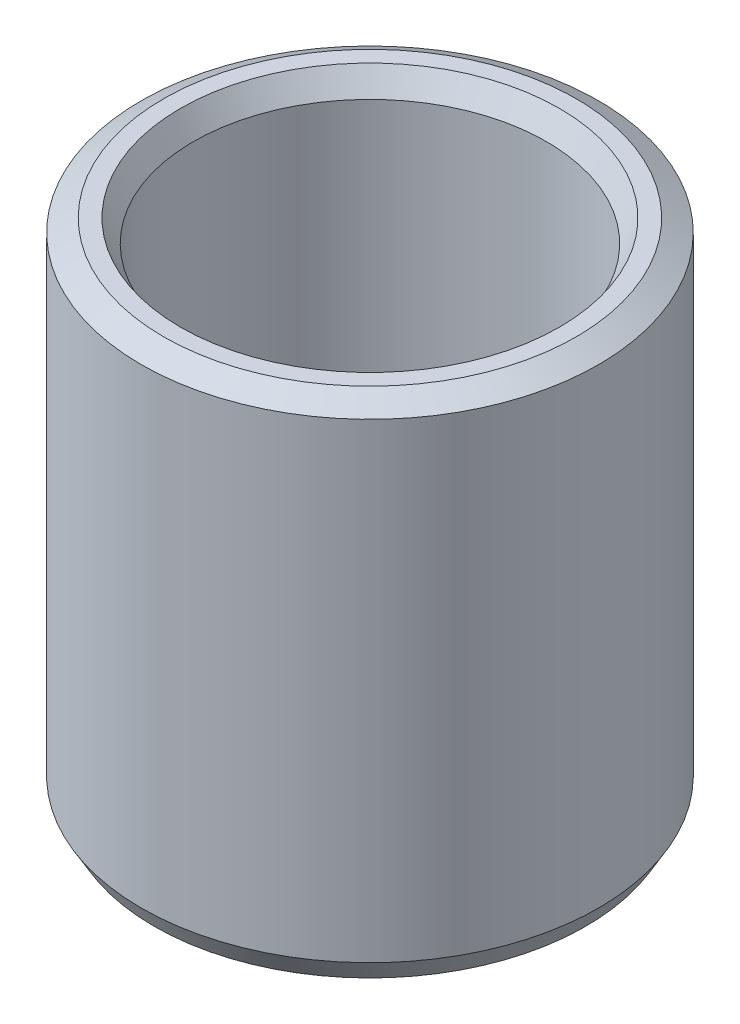
ISO-10303-21;
HEADER;
FILE_DESCRIPTION(('STEP AP214'),'2;1');
FILE_NAME('part.step','',(''),(''),'','','');
FILE_SCHEMA(('AUTOMOTIVE_DESIGN { 1 0 10303 214 1 1 1 1 }'));
ENDSEC;
DATA;
#1=APPLICATION_CONTEXT('core data for automotive mechanical design processes');
#2=APPLICATION_PROTOCOL_DEFINITION('international standard','automotive_design',2000,#1);
#3=PRODUCT_CONTEXT('',#1,'mechanical');
#4=PRODUCT('Part','Part','',(#3));
#5=PRODUCT_RELATED_PRODUCT_CATEGORY('part','',(#4));
#6=PRODUCT_DEFINITION_FORMATION('','',#4);
#7=PRODUCT_DEFINITION_CONTEXT('part definition',#1,'design');
#8=PRODUCT_DEFINITION('design','',#6,#7);
#9=PRODUCT_DEFINITION_SHAPE('','',#8);
#10=(LENGTH_UNIT() NAMED_UNIT(*) SI_UNIT(.MILLI.,.METRE.));
#11=(NAMED_UNIT(*) PLANE_ANGLE_UNIT() SI_UNIT($,.RADIAN.));
#12=(NAMED_UNIT(*) SI_UNIT($,.STERADIAN.) SOLID_ANGLE_UNIT());
#13=UNCERTAINTY_MEASURE_WITH_UNIT(LENGTH_MEASURE(1.E-05),#10,'distance_accuracy_value','');
#14=(GEOMETRIC_REPRESENTATION_CONTEXT(3) GLOBAL_UNCERTAINTY_ASSIGNED_CONTEXT((#13)) GLOBAL_UNIT_ASSIGNED_CONTEXT((#10,
#11,#12)) REPRESENTATION_CONTEXT('',''));
#15=CARTESIAN_POINT('',(0.,0.,0.));
#16=DIRECTION('',(0.,0.,1.));
#17=DIRECTION('',(1.,0.,0.));
#18=AXIS2_PLACEMENT_3D('',#15,#16,#17);
#19=CARTESIAN_POINT('',(0.,110.624641812526,0.));
#20=DIRECTION('',(0.,-1.,0.));
#21=DIRECTION('',(0.,0.,-1.));
#22=AXIS2_PLACEMENT_3D('',#19,#20,#21);
#23=CYLINDRICAL_SURFACE('',#22,50.);
#24=CARTESIAN_POINT('',(0.,4.88620074329169,0.));
#25=DIRECTION('',(0.,1.,0.));
#26=DIRECTION('',(0.,0.,1.));
#27=AXIS2_PLACEMENT_3D('',#24,#25,#26);
#28=CIRCLE('',#27,50.);
#29=CARTESIAN_POINT('',(0.,4.88620074329169,50.));
#30=VERTEX_POINT('',#29);
#31=EDGE_CURVE('E10',#30,#30,#28,.T.);
#32=ORIENTED_EDGE('',*,*,#31,.T.);
#33=EDGE_LOOP('',(#32));
#34=FACE_BOUND('',#33,.T.);
#35=CARTESIAN_POINT('',(0.,107.803592498072,0.));
#36=DIRECTION('',(0.,1.,0.));
#37=DIRECTION('',(0.,0.,1.));
#38=AXIS2_PLACEMENT_3D('',#35,#36,#37);
#39=CIRCLE('',#38,50.);
#40=CARTESIAN_POINT('',(0.,107.803592498072,50.));
#41=VERTEX_POINT('',#40);
#42=EDGE_CURVE('E50',#41,#41,#39,.F.);
#43=ORIENTED_EDGE('',*,*,#42,.T.);
#44=EDGE_LOOP('',(#43));
#45=FACE_BOUND('',#44,.T.);
#46=ADVANCED_FACE('F39',(#34,#45),#23,.T.);
#47=CARTESIAN_POINT('',(0.,110.624641812526,0.));
#48=DIRECTION('',(0.,1.,0.));
#49=DIRECTION('',(0.,0.,1.));
#50=AXIS2_PLACEMENT_3D('',#47,#48,#49);
#51=PLANE('',#50);
#52=CARTESIAN_POINT('',(0.,110.624641812526,0.));
#53=DIRECTION('',(0.,1.,0.));
#54=DIRECTION('',(0.,0.,1.));
#55=AXIS2_PLACEMENT_3D('',#52,#53,#54);
#56=CIRCLE('',#55,41.4435960448533);
#57=CARTESIAN_POINT('',(0.,110.624641812526,41.4435960448533));
#58=VERTEX_POINT('',#57);
#59=EDGE_CURVE('E58',#58,#58,#56,.F.);
#60=ORIENTED_EDGE('',*,*,#59,.T.);
#61=EDGE_LOOP('',(#60));
#62=FACE_BOUND('',#61,.T.);
#63=CARTESIAN_POINT('',(0.,110.624641812526,0.));
#64=DIRECTION('',(0.,1.,0.));
#65=DIRECTION('',(0.,0.,1.));
#66=AXIS2_PLACEMENT_3D('',#63,#64,#65);
#67=CIRCLE('',#66,45.1137992567082);
#68=CARTESIAN_POINT('',(0.,110.624641812526,45.1137992567082));
#69=VERTEX_POINT('',#68);
#70=EDGE_CURVE('E61',#69,#69,#67,.T.);
#71=ORIENTED_EDGE('',*,*,#70,.T.);
#72=EDGE_LOOP('',(#71));
#73=FACE_BOUND('',#72,.T.);
#74=ADVANCED_FACE('F88',(#62,#73),#51,.T.);
#75=CARTESIAN_POINT('',(0.,0.,0.));
#76=DIRECTION('',(0.,1.,0.));
#77=DIRECTION('',(0.,0.,1.));
#78=AXIS2_PLACEMENT_3D('',#75,#76,#77);
#79=PLANE('',#78);
#80=CARTESIAN_POINT('',(0.,0.,0.));
#81=DIRECTION('',(0.,1.,0.));
#82=DIRECTION('',(0.,0.,1.));
#83=AXIS2_PLACEMENT_3D('',#80,#81,#82);
#84=CIRCLE('',#83,43.508747473691);
#85=CARTESIAN_POINT('',(0.,0.,43.508747473691));
#86=VERTEX_POINT('',#85);
#87=EDGE_CURVE('E51',#86,#86,#84,.T.);
#88=ORIENTED_EDGE('',*,*,#87,.T.);
#89=EDGE_LOOP('',(#88));
#90=FACE_BOUND('',#89,.T.);
#91=CARTESIAN_POINT('',(0.,0.,0.));
#92=DIRECTION('',(0.,1.,0.));
#93=DIRECTION('',(0.,0.,1.));
#94=AXIS2_PLACEMENT_3D('',#91,#92,#93);
#95=CIRCLE('',#94,47.178950685546);
#96=CARTESIAN_POINT('',(0.,0.,47.178950685546));
#97=VERTEX_POINT('',#96);
#98=EDGE_CURVE('E54',#97,#97,#95,.F.);
#99=ORIENTED_EDGE('',*,*,#98,.T.);
#100=EDGE_LOOP('',(#99));
#101=FACE_BOUND('',#100,.T.);
#102=ADVANCED_FACE('F83',(#90,#101),#79,.F.);
#103=CARTESIAN_POINT('',(0.,110.624641812526,0.));
#104=DIRECTION('',(0.,-1.,0.));
#105=DIRECTION('',(0.,0.,-1.));
#106=AXIS2_PLACEMENT_3D('',#103,#104,#105);
#107=CYLINDRICAL_SURFACE('',#106,38.6225467303992);
#108=CARTESIAN_POINT('',(0.,105.738441069234,0.));
#109=DIRECTION('',(0.,1.,0.));
#110=DIRECTION('',(0.,0.,1.));
#111=AXIS2_PLACEMENT_3D('',#108,#109,#110);
#112=CIRCLE('',#111,38.6225467303992);
#113=CARTESIAN_POINT('',(0.,105.738441069234,38.6225467303992));
#114=VERTEX_POINT('',#113);
#115=EDGE_CURVE('E67',#114,#114,#112,.T.);
#116=ORIENTED_EDGE('',*,*,#115,.T.);
#117=EDGE_LOOP('',(#116));
#118=FACE_BOUND('',#117,.T.);
#119=CARTESIAN_POINT('',(0.,2.82104931445408,0.));
#120=DIRECTION('',(0.,1.,0.));
#121=DIRECTION('',(0.,0.,1.));
#122=AXIS2_PLACEMENT_3D('',#119,#120,#121);
#123=CIRCLE('',#122,38.6225467303992);
#124=CARTESIAN_POINT('',(0.,2.82104931445408,38.6225467303992));
#125=VERTEX_POINT('',#124);
#126=EDGE_CURVE('E69',#125,#125,#123,.F.);
#127=ORIENTED_EDGE('',*,*,#126,.T.);
#128=EDGE_LOOP('',(#127));
#129=FACE_BOUND('',#128,.T.);
#130=ADVANCED_FACE('F71',(#118,#129),#107,.F.);
#131=CARTESIAN_POINT('',(0.,105.738441069234,0.));
#132=DIRECTION('',(0.,1.,0.));
#133=DIRECTION('',(0.,0.,1.));
#134=AXIS2_PLACEMENT_3D('',#131,#132,#133);
#135=CONICAL_SURFACE('',#134,38.6225467303992,0.523598775598304);
#136=CARTESIAN_POINT('',(0.,110.624641812526,41.4435960448533));
#137=CARTESIAN_POINT('',(0.,110.573743888117,41.4142101144944));
#138=CARTESIAN_POINT('',(0.,110.522845963707,41.3848241841355));
#139=CARTESIAN_POINT('',(0.,110.421050114889,41.3260523234177));
#140=CARTESIAN_POINT('',(0.,110.370152190479,41.2966663930588));
#141=CARTESIAN_POINT('',(0.,110.268356341661,41.237894532341));
#142=CARTESIAN_POINT('',(0.,110.217458417251,41.2085086019821));
#143=CARTESIAN_POINT('',(0.,110.115662568433,41.1497367412643));
#144=CARTESIAN_POINT('',(0.,110.064764644024,41.1203508109054));
#145=CARTESIAN_POINT('',(0.,109.962968795205,41.0615789501876));
#146=CARTESIAN_POINT('',(0.,109.912070870796,41.0321930198287));
#147=CARTESIAN_POINT('',(0.,109.810275021977,40.9734211591109));
#148=CARTESIAN_POINT('',(0.,109.759377097568,40.9440352287521));
#149=CARTESIAN_POINT('',(0.,109.657581248749,40.8852633680343));
#150=CARTESIAN_POINT('',(0.,109.60668332434,40.8558774376754));
#151=CARTESIAN_POINT('',(0.,109.504887475521,40.7971055769576));
#152=CARTESIAN_POINT('',(0.,109.453989551112,40.7677196465987));
#153=CARTESIAN_POINT('',(0.,109.352193702294,40.7089477858809));
#154=CARTESIAN_POINT('',(0.,109.301295777884,40.679561855522));
#155=CARTESIAN_POINT('',(0.,109.199499929066,40.6207899948042));
#156=CARTESIAN_POINT('',(0.,109.148602004656,40.5914040644453));
#157=CARTESIAN_POINT('',(0.,109.046806155838,40.5326322037275));
#158=CARTESIAN_POINT('',(0.,108.995908231429,40.5032462733686));
#159=CARTESIAN_POINT('',(0.,108.89411238261,40.4444744126508));
#160=CARTESIAN_POINT('',(0.,108.843214458201,40.4150884822919));
#161=CARTESIAN_POINT('',(0.,108.741418609382,40.3563166215741));
#162=CARTESIAN_POINT('',(0.,108.690520684973,40.3269306912152));
#163=CARTESIAN_POINT('',(0.,108.588724836154,40.2681588304974));
#164=CARTESIAN_POINT('',(0.,108.537826911745,40.2387729001385));
#165=CARTESIAN_POINT('',(0.,108.436031062926,40.1800010394207));
#166=CARTESIAN_POINT('',(0.,108.385133138517,40.1506151090618));
#167=CARTESIAN_POINT('',(0.,108.283337289698,40.091843248344));
#168=CARTESIAN_POINT('',(0.,108.232439365289,40.0624573179851));
#169=CARTESIAN_POINT('',(0.,108.130643516471,40.0036854572673));
#170=CARTESIAN_POINT('',(0.,108.079745592061,39.9742995269084));
#171=CARTESIAN_POINT('',(0.,107.977949743243,39.9155276661907));
#172=CARTESIAN_POINT('',(0.,107.927051818833,39.8861417358318));
#173=CARTESIAN_POINT('',(0.,107.825255970015,39.827369875114));
#174=CARTESIAN_POINT('',(0.,107.774358045606,39.7979839447551));
#175=CARTESIAN_POINT('',(0.,107.672562196787,39.7392120840373));
#176=CARTESIAN_POINT('',(0.,107.621664272378,39.7098261536784));
#177=CARTESIAN_POINT('',(0.,107.519868423559,39.6510542929606));
#178=CARTESIAN_POINT('',(0.,107.46897049915,39.6216683626017));
#179=CARTESIAN_POINT('',(0.,107.367174650331,39.5628965018839));
#180=CARTESIAN_POINT('',(0.,107.316276725922,39.533510571525));
#181=CARTESIAN_POINT('',(0.,107.214480877103,39.4747387108072));
#182=CARTESIAN_POINT('',(0.,107.163582952694,39.4453527804483));
#183=CARTESIAN_POINT('',(0.,107.061787103876,39.3865809197305));
#184=CARTESIAN_POINT('',(0.,107.010889179466,39.3571949893716));
#185=CARTESIAN_POINT('',(0.,106.909093330648,39.2984231286538));
#186=CARTESIAN_POINT('',(0.,106.858195406238,39.2690371982949));
#187=CARTESIAN_POINT('',(0.,106.75639955742,39.2102653375771));
#188=CARTESIAN_POINT('',(0.,106.70550163301,39.1808794072182));
#189=CARTESIAN_POINT('',(0.,106.603705784192,39.1221075465004));
#190=CARTESIAN_POINT('',(0.,106.552807859783,39.0927216161415));
#191=CARTESIAN_POINT('',(0.,106.451012010964,39.0339497554237));
#192=CARTESIAN_POINT('',(0.,106.400114086555,39.0045638250649));
#193=CARTESIAN_POINT('',(0.,106.298318237736,38.9457919643471));
#194=CARTESIAN_POINT('',(0.,106.247420313327,38.9164060339882));
#195=CARTESIAN_POINT('',(0.,106.145624464508,38.8576341732704));
#196=CARTESIAN_POINT('',(0.,106.094726540099,38.8282482429115));
#197=CARTESIAN_POINT('',(0.,105.99293069128,38.7694763821937));
#198=CARTESIAN_POINT('',(0.,105.942032766871,38.7400904518348));
#199=CARTESIAN_POINT('',(0.,105.840236918053,38.681318591117));
#200=CARTESIAN_POINT('',(0.,105.789338993643,38.6519326607581));
#201=CARTESIAN_POINT('',(0.,105.738441069234,38.6225467303992));
#202=B_SPLINE_CURVE_WITH_KNOTS('',3,(#136,#137,#138,#139,#140,#141,#142,#143,#144,#145,#146,
#147,#148,#149,#150,#151,#152,#153,#154,#155,#156,#157,#158,#159,#160,#161,#162,#163,#164,#165,
#166,#167,#168,#169,#170,#171,#172,#173,#174,#175,#176,#177,#178,#179,#180,#181,#182,#183,#184,
#185,#186,#187,#188,#189,#190,#191,#192,#193,#194,#195,#196,#197,#198,#199,#200,#201),
.UNSPECIFIED.,.F.,.F.,(4,2,2,2,2,2,2,2,2,2,2,2,2,2,2,2,2,2,2,2,2,2,2,2,2,2,2,2,2,2,2,2,4),(0.,
0.176315582153392,0.352631164306769,0.528946746460145,0.705262328613525,0.881577910766914,
1.05789349292029,1.23420907507367,1.41052465722705,1.58684023938042,1.76315582153382,
1.93947140368719,2.11578698584057,2.29210256799395,2.46841815014734,2.64473373230071,
2.82104931445409,2.99736489660747,3.17368047876085,3.34999606091423,3.52631164306761,
3.70262722522099,3.87894280737437,4.05525838952776,4.23157397168114,4.40788955383451,
4.58420513598789,4.76052071814127,4.93683630029466,5.11315188244804,5.28946746460141,
5.46578304675479,5.64209862890817),.UNSPECIFIED.);
#203=EDGE_CURVE('BSEAM77',#58,#114,#202,.T.);
#204=ORIENTED_EDGE('',*,*,#59,.F.);
#205=ORIENTED_EDGE('',*,*,#115,.F.);
#206=ORIENTED_EDGE('',*,*,#203,.T.);
#207=ORIENTED_EDGE('',*,*,#203,.F.);
#208=EDGE_LOOP('',(#204,#206,#205,#207));
#209=FACE_BOUND('',#208,.T.);
#210=ADVANCED_FACE('F77',(#209),#135,.F.);
#211=CARTESIAN_POINT('',(0.,0.,0.));
#212=DIRECTION('',(0.,-1.,0.));
#213=DIRECTION('',(0.,0.,-1.));
#214=AXIS2_PLACEMENT_3D('',#211,#212,#213);
#215=CONICAL_SURFACE('',#214,43.508747473691,1.0471975511966);
#216=ORIENTED_EDGE('',*,*,#126,.F.);
#217=EDGE_LOOP('',(#216));
#218=FACE_BOUND('',#217,.T.);
#219=ORIENTED_EDGE('',*,*,#87,.F.);
#220=EDGE_LOOP('',(#219));
#221=FACE_BOUND('',#220,.T.);
#222=ADVANCED_FACE('F73',(#218,#221),#215,.F.);
#223=CARTESIAN_POINT('',(0.,4.88620074329169,0.));
#224=DIRECTION('',(0.,1.,0.));
#225=DIRECTION('',(0.,0.,1.));
#226=AXIS2_PLACEMENT_3D('',#223,#224,#225);
#227=CONICAL_SURFACE('',#226,50.,0.523598775598304);
#228=CARTESIAN_POINT('',(0.,0.,47.178950685546));
#229=CARTESIAN_POINT('',(0.,0.0508979244092874,47.2083366159049));
#230=CARTESIAN_POINT('',(0.,0.101795848818576,47.2377225462638));
#231=CARTESIAN_POINT('',(0.,0.203591697637153,47.2964944069815));
#232=CARTESIAN_POINT('',(0.,0.254489622046441,47.3258803373405));
#233=CARTESIAN_POINT('',(0.,0.356285470865018,47.3846521980582));
#234=CARTESIAN_POINT('',(0.,0.407183395274306,47.4140381284171));
#235=CARTESIAN_POINT('',(0.,0.508979244092883,47.4728099891349));
#236=CARTESIAN_POINT('',(0.,0.559877168502171,47.5021959194938));
#237=CARTESIAN_POINT('',(0.,0.661673017320748,47.5609677802116));
#238=CARTESIAN_POINT('',(0.,0.712570941730037,47.5903537105705));
#239=CARTESIAN_POINT('',(0.,0.814366790548613,47.6491255712883));
#240=CARTESIAN_POINT('',(0.,0.865264714957902,47.6785115016472));
#241=CARTESIAN_POINT('',(0.,0.967060563776479,47.737283362365));
#242=CARTESIAN_POINT('',(0.,1.01795848818577,47.7666692927239));
#243=CARTESIAN_POINT('',(0.,1.11975433700434,47.8254411534417));
#244=CARTESIAN_POINT('',(0.,1.17065226141363,47.8548270838006));
#245=CARTESIAN_POINT('',(0.,1.27244811023221,47.9135989445184));
#246=CARTESIAN_POINT('',(0.,1.3233460346415,47.9429848748773));
#247=CARTESIAN_POINT('',(0.,1.42514188346007,48.0017567355951));
#248=CARTESIAN_POINT('',(0.,1.47603980786936,48.031142665954));
#249=CARTESIAN_POINT('',(0.,1.57783565668794,48.0899145266717));
#250=CARTESIAN_POINT('',(0.,1.62873358109723,48.1193004570306));
#251=CARTESIAN_POINT('',(0.,1.7305294299158,48.1780723177484));
#252=CARTESIAN_POINT('',(0.,1.78142735432509,48.2074582481073));
#253=CARTESIAN_POINT('',(0.,1.88322320314367,48.2662301088251));
#254=CARTESIAN_POINT('',(0.,1.93412112755296,48.295616039184));
#255=CARTESIAN_POINT('',(0.,2.03591697637154,48.3543878999018));
#256=CARTESIAN_POINT('',(0.,2.08681490078082,48.3837738302607));
#257=CARTESIAN_POINT('',(0.,2.1886107495994,48.4425456909785));
#258=CARTESIAN_POINT('',(0.,2.23950867400869,48.4719316213374));
#259=CARTESIAN_POINT('',(0.,2.34130452282727,48.5307034820552));
#260=CARTESIAN_POINT('',(0.,2.39220244723655,48.5600894124141));
#261=CARTESIAN_POINT('',(0.,2.49399829605513,48.6188612731319));
#262=CARTESIAN_POINT('',(0.,2.54489622046442,48.6482472034908));
#263=CARTESIAN_POINT('',(0.,2.646692069283,48.7070190642086));
#264=CARTESIAN_POINT('',(0.,2.69758999369228,48.7364049945675));
#265=CARTESIAN_POINT('',(0.,2.79938584251086,48.7951768552853));
#266=CARTESIAN_POINT('',(0.,2.85028376692015,48.8245627856442));
#267=CARTESIAN_POINT('',(0.,2.95207961573873,48.8833346463619));
#268=CARTESIAN_POINT('',(0.,3.00297754014801,48.9127205767208));
#269=CARTESIAN_POINT('',(0.,3.10477338896659,48.9714924374386));
#270=CARTESIAN_POINT('',(0.,3.15567131337588,49.0008783677975));
#271=CARTESIAN_POINT('',(0.,3.25746716219446,49.0596502285153));
#272=CARTESIAN_POINT('',(0.,3.30836508660375,49.0890361588742));
#273=CARTESIAN_POINT('',(0.,3.41016093542232,49.147808019592));
#274=CARTESIAN_POINT('',(0.,3.46105885983161,49.1771939499509));
#275=CARTESIAN_POINT('',(0.,3.56285470865019,49.2359658106687));
#276=CARTESIAN_POINT('',(0.,3.61375263305948,49.2653517410276));
#277=CARTESIAN_POINT('',(0.,3.71554848187805,49.3241236017454));
#278=CARTESIAN_POINT('',(0.,3.76644640628734,49.3535095321043));
#279=CARTESIAN_POINT('',(0.,3.86824225510592,49.4122813928221));
#280=CARTESIAN_POINT('',(0.,3.91914017951521,49.441667323181));
#281=CARTESIAN_POINT('',(0.,4.02093602833378,49.5004391838988));
#282=CARTESIAN_POINT('',(0.,4.07183395274307,49.5298251142577));
#283=CARTESIAN_POINT('',(0.,4.17362980156165,49.5885969749755));
#284=CARTESIAN_POINT('',(0.,4.22452772597094,49.6179829053344));
#285=CARTESIAN_POINT('',(0.,4.32632357478951,49.6767547660521));
#286=CARTESIAN_POINT('',(0.,4.3772214991988,49.706140696411));
#287=CARTESIAN_POINT('',(0.,4.47901734801738,49.7649125571288));
#288=CARTESIAN_POINT('',(0.,4.52991527242667,49.7942984874877));
#289=CARTESIAN_POINT('',(0.,4.63171112124524,49.8530703482055));
#290=CARTESIAN_POINT('',(0.,4.68260904565453,49.8824562785644));
#291=CARTESIAN_POINT('',(0.,4.78440489447311,49.9412281392822));
#292=CARTESIAN_POINT('',(0.,4.8353028188824,49.9706140696411));
#293=CARTESIAN_POINT('',(0.,4.88620074329169,50.));
#294=B_SPLINE_CURVE_WITH_KNOTS('',3,(#228,#229,#230,#231,#232,#233,#234,#235,#236,#237,#238,
#239,#240,#241,#242,#243,#244,#245,#246,#247,#248,#249,#250,#251,#252,#253,#254,#255,#256,#257,
#258,#259,#260,#261,#262,#263,#264,#265,#266,#267,#268,#269,#270,#271,#272,#273,#274,#275,#276,
#277,#278,#279,#280,#281,#282,#283,#284,#285,#286,#287,#288,#289,#290,#291,#292,#293),
.UNSPECIFIED.,.F.,.F.,(4,2,2,2,2,2,2,2,2,2,2,2,2,2,2,2,2,2,2,2,2,2,2,2,2,2,2,2,2,2,2,2,4),(0.,
0.176315582153376,0.352631164306752,0.528946746460127,0.705262328613503,0.881577910766879,
1.05789349292025,1.23420907507363,1.41052465722701,1.58684023938038,1.76315582153376,
1.93947140368713,2.11578698584051,2.29210256799389,2.46841815014726,2.64473373230064,
2.82104931445401,2.99736489660739,3.17368047876076,3.34999606091414,3.52631164306751,
3.70262722522089,3.87894280737427,4.05525838952764,4.23157397168102,4.40788955383439,
4.58420513598777,4.76052071814115,4.93683630029452,5.1131518824479,5.28946746460127,
5.46578304675465,5.64209862890802),.UNSPECIFIED.);
#295=EDGE_CURVE('BSEAM76',#97,#30,#294,.T.);
#296=ORIENTED_EDGE('',*,*,#98,.F.);
#297=ORIENTED_EDGE('',*,*,#31,.F.);
#298=ORIENTED_EDGE('',*,*,#295,.T.);
#299=ORIENTED_EDGE('',*,*,#295,.F.);
#300=EDGE_LOOP('',(#296,#298,#297,#299));
#301=FACE_BOUND('',#300,.T.);
#302=ADVANCED_FACE('F76',(#301),#227,.T.);
#303=CARTESIAN_POINT('',(0.,110.624641812526,0.));
#304=DIRECTION('',(0.,-1.,0.));
#305=DIRECTION('',(0.,0.,-1.));
#306=AXIS2_PLACEMENT_3D('',#303,#304,#305);
#307=CONICAL_SURFACE('',#306,45.1137992567082,1.04719755119659);
#308=ORIENTED_EDGE('',*,*,#42,.F.);
#309=EDGE_LOOP('',(#308));
#310=FACE_BOUND('',#309,.T.);
#311=ORIENTED_EDGE('',*,*,#70,.F.);
#312=EDGE_LOOP('',(#311));
#313=FACE_BOUND('',#312,.T.);
#314=ADVANCED_FACE('F45',(#310,#313),#307,.T.);
#315=CLOSED_SHELL('',(#46,#74,#102,#130,#210,#222,#302,#314));
#316=MANIFOLD_SOLID_BREP('B2',#315);
#317=ADVANCED_BREP_SHAPE_REPRESENTATION('',(#18,#316),#14);
#318=SHAPE_DEFINITION_REPRESENTATION(#9,#317);
ENDSEC;
END-ISO-10303-21;
